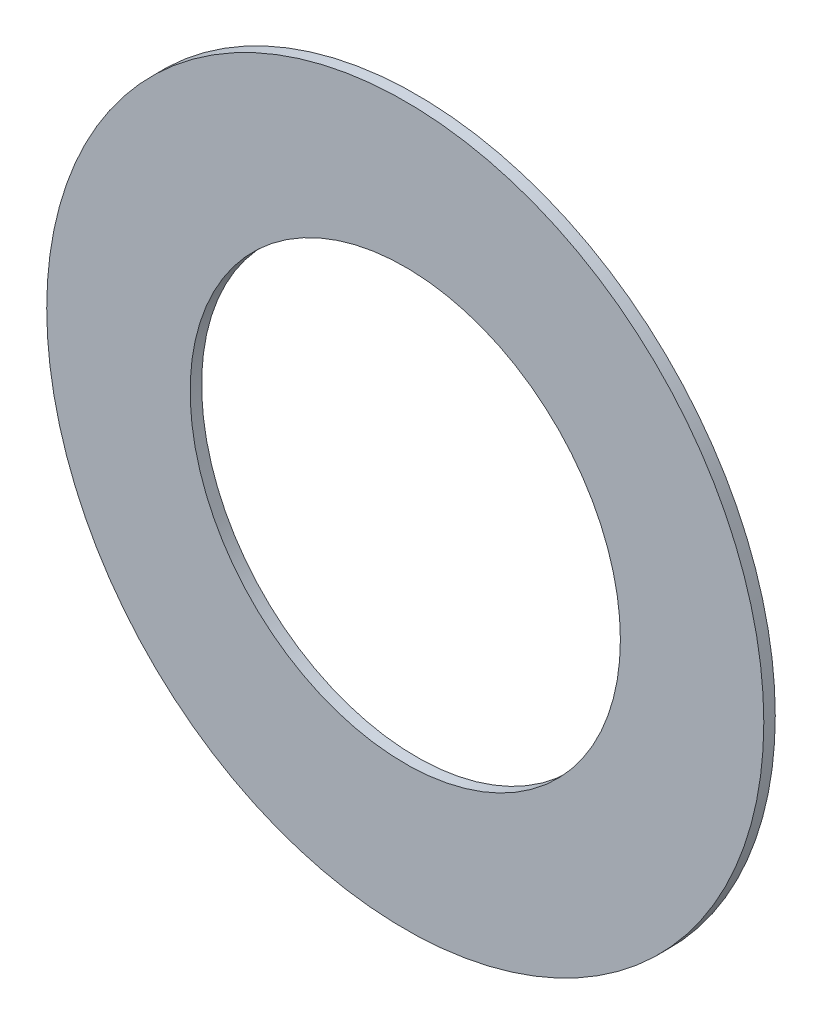
ISO-10303-21;
HEADER;
FILE_DESCRIPTION(('STEP AP214'),'2;1');
FILE_NAME('part.step','',(''),(''),'','','');
FILE_SCHEMA(('AUTOMOTIVE_DESIGN { 1 0 10303 214 1 1 1 1 }'));
ENDSEC;
DATA;
#1=APPLICATION_CONTEXT('core data for automotive mechanical design processes');
#2=APPLICATION_PROTOCOL_DEFINITION('international standard','automotive_design',2000,#1);
#3=PRODUCT_CONTEXT('',#1,'mechanical');
#4=PRODUCT('Part','Part','',(#3));
#5=PRODUCT_RELATED_PRODUCT_CATEGORY('part','',(#4));
#6=PRODUCT_DEFINITION_FORMATION('','',#4);
#7=PRODUCT_DEFINITION_CONTEXT('part definition',#1,'design');
#8=PRODUCT_DEFINITION('design','',#6,#7);
#9=PRODUCT_DEFINITION_SHAPE('','',#8);
#10=(LENGTH_UNIT() NAMED_UNIT(*) SI_UNIT(.MILLI.,.METRE.));
#11=(NAMED_UNIT(*) PLANE_ANGLE_UNIT() SI_UNIT($,.RADIAN.));
#12=(NAMED_UNIT(*) SI_UNIT($,.STERADIAN.) SOLID_ANGLE_UNIT());
#13=UNCERTAINTY_MEASURE_WITH_UNIT(LENGTH_MEASURE(1.E-05),#10,'distance_accuracy_value','');
#14=(GEOMETRIC_REPRESENTATION_CONTEXT(3) GLOBAL_UNCERTAINTY_ASSIGNED_CONTEXT((#13)) GLOBAL_UNIT_ASSIGNED_CONTEXT((#10,
#11,#12)) REPRESENTATION_CONTEXT('',''));
#15=CARTESIAN_POINT('',(0.,0.,0.));
#16=DIRECTION('',(0.,0.,1.));
#17=DIRECTION('',(1.,0.,0.));
#18=AXIS2_PLACEMENT_3D('',#15,#16,#17);
#19=CARTESIAN_POINT('',(0.,0.,0.254));
#20=DIRECTION('',(0.,0.,1.));
#21=DIRECTION('',(1.,0.,0.));
#22=AXIS2_PLACEMENT_3D('',#19,#20,#21);
#23=PLANE('',#22);
#24=CARTESIAN_POINT('',(0.,0.,0.254));
#25=DIRECTION('',(0.,0.,1.));
#26=DIRECTION('',(1.,0.,0.));
#27=AXIS2_PLACEMENT_3D('',#24,#25,#26);
#28=CIRCLE('',#27,7.9375);
#29=CARTESIAN_POINT('',(7.9375,0.,0.254));
#30=VERTEX_POINT('',#29);
#31=EDGE_CURVE('E10',#30,#30,#28,.T.);
#32=ORIENTED_EDGE('',*,*,#31,.T.);
#33=EDGE_LOOP('',(#32));
#34=FACE_BOUND('',#33,.T.);
#35=CARTESIAN_POINT('',(0.,0.,0.254));
#36=DIRECTION('',(0.,0.,1.));
#37=DIRECTION('',(1.,0.,0.));
#38=AXIS2_PLACEMENT_3D('',#35,#36,#37);
#39=CIRCLE('',#38,4.7625);
#40=CARTESIAN_POINT('',(4.7625,0.,0.254));
#41=VERTEX_POINT('',#40);
#42=EDGE_CURVE('E42',#41,#41,#39,.T.);
#43=ORIENTED_EDGE('',*,*,#42,.F.);
#44=EDGE_LOOP('',(#43));
#45=FACE_BOUND('',#44,.T.);
#46=ADVANCED_FACE('F31',(#34,#45),#23,.T.);
#47=CARTESIAN_POINT('',(0.,0.,0.));
#48=DIRECTION('',(0.,0.,1.));
#49=DIRECTION('',(1.,0.,0.));
#50=AXIS2_PLACEMENT_3D('',#47,#48,#49);
#51=PLANE('',#50);
#52=CARTESIAN_POINT('',(0.,0.,0.));
#53=DIRECTION('',(0.,0.,1.));
#54=DIRECTION('',(1.,0.,0.));
#55=AXIS2_PLACEMENT_3D('',#52,#53,#54);
#56=CIRCLE('',#55,7.9375);
#57=CARTESIAN_POINT('',(7.9375,0.,0.));
#58=VERTEX_POINT('',#57);
#59=EDGE_CURVE('E35',#58,#58,#56,.T.);
#60=ORIENTED_EDGE('',*,*,#59,.F.);
#61=EDGE_LOOP('',(#60));
#62=FACE_BOUND('',#61,.T.);
#63=CARTESIAN_POINT('',(0.,0.,0.));
#64=DIRECTION('',(0.,0.,1.));
#65=DIRECTION('',(1.,0.,0.));
#66=AXIS2_PLACEMENT_3D('',#63,#64,#65);
#67=CIRCLE('',#66,4.7625);
#68=CARTESIAN_POINT('',(4.7625,0.,0.));
#69=VERTEX_POINT('',#68);
#70=EDGE_CURVE('E44',#69,#69,#67,.T.);
#71=ORIENTED_EDGE('',*,*,#70,.T.);
#72=EDGE_LOOP('',(#71));
#73=FACE_BOUND('',#72,.T.);
#74=ADVANCED_FACE('F54',(#62,#73),#51,.F.);
#75=CARTESIAN_POINT('',(0.,0.,0.254));
#76=DIRECTION('',(0.,0.,-1.));
#77=DIRECTION('',(-1.,0.,0.));
#78=AXIS2_PLACEMENT_3D('',#75,#76,#77);
#79=CYLINDRICAL_SURFACE('',#78,7.9375);
#80=ORIENTED_EDGE('',*,*,#31,.F.);
#81=EDGE_LOOP('',(#80));
#82=FACE_BOUND('',#81,.T.);
#83=ORIENTED_EDGE('',*,*,#59,.T.);
#84=EDGE_LOOP('',(#83));
#85=FACE_BOUND('',#84,.T.);
#86=ADVANCED_FACE('F33',(#82,#85),#79,.T.);
#87=CARTESIAN_POINT('',(0.,0.,0.254));
#88=DIRECTION('',(0.,0.,-1.));
#89=DIRECTION('',(-1.,0.,0.));
#90=AXIS2_PLACEMENT_3D('',#87,#88,#89);
#91=CYLINDRICAL_SURFACE('',#90,4.7625);
#92=ORIENTED_EDGE('',*,*,#42,.T.);
#93=EDGE_LOOP('',(#92));
#94=FACE_BOUND('',#93,.T.);
#95=ORIENTED_EDGE('',*,*,#70,.F.);
#96=EDGE_LOOP('',(#95));
#97=FACE_BOUND('',#96,.T.);
#98=ADVANCED_FACE('F50',(#94,#97),#91,.F.);
#99=CLOSED_SHELL('',(#46,#74,#86,#98));
#100=MANIFOLD_SOLID_BREP('B2',#99);
#101=ADVANCED_BREP_SHAPE_REPRESENTATION('',(#18,#100),#14);
#102=SHAPE_DEFINITION_REPRESENTATION(#9,#101);
ENDSEC;
END-ISO-10303-21;
